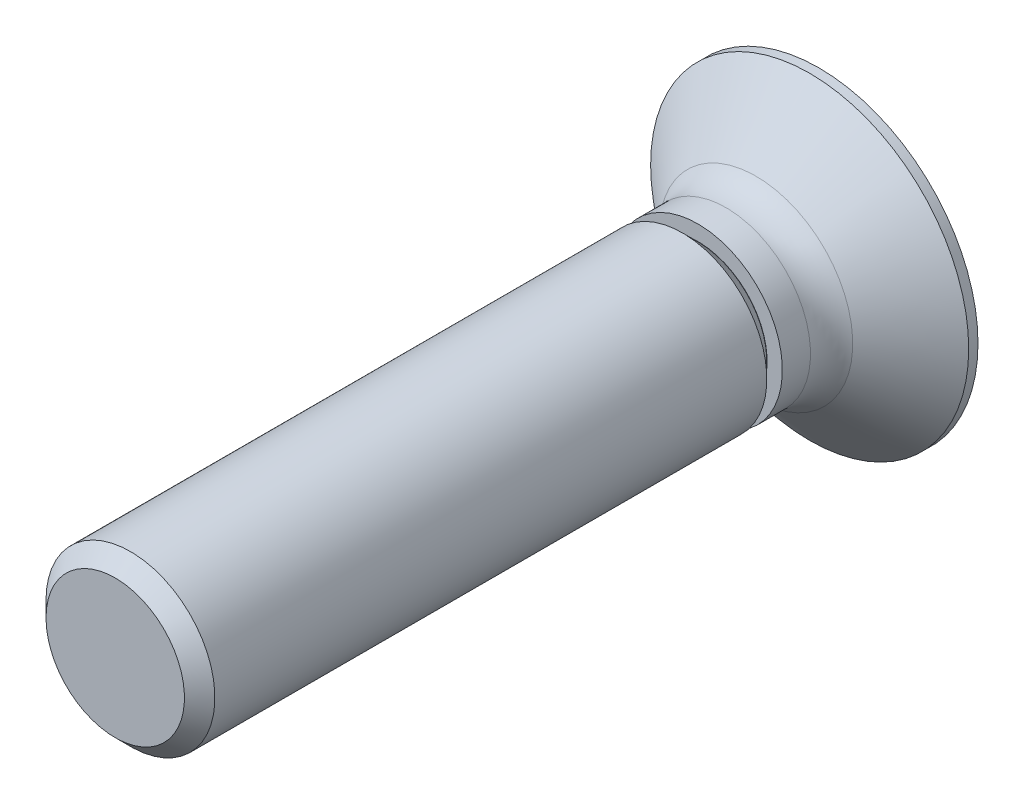
ISO-10303-21;
HEADER;
FILE_DESCRIPTION(('STEP AP214'),'2;1');
FILE_NAME('part.step','',(''),(''),'','','');
FILE_SCHEMA(('AUTOMOTIVE_DESIGN { 1 0 10303 214 1 1 1 1 }'));
ENDSEC;
DATA;
#1=APPLICATION_CONTEXT('core data for automotive mechanical design processes');
#2=APPLICATION_PROTOCOL_DEFINITION('international standard','automotive_design',2000,#1);
#3=PRODUCT_CONTEXT('',#1,'mechanical');
#4=PRODUCT('Part','Part','',(#3));
#5=PRODUCT_RELATED_PRODUCT_CATEGORY('part','',(#4));
#6=PRODUCT_DEFINITION_FORMATION('','',#4);
#7=PRODUCT_DEFINITION_CONTEXT('part definition',#1,'design');
#8=PRODUCT_DEFINITION('design','',#6,#7);
#9=PRODUCT_DEFINITION_SHAPE('','',#8);
#10=(LENGTH_UNIT() NAMED_UNIT(*) SI_UNIT(.MILLI.,.METRE.));
#11=(NAMED_UNIT(*) PLANE_ANGLE_UNIT() SI_UNIT($,.RADIAN.));
#12=(NAMED_UNIT(*) SI_UNIT($,.STERADIAN.) SOLID_ANGLE_UNIT());
#13=UNCERTAINTY_MEASURE_WITH_UNIT(LENGTH_MEASURE(1.E-05),#10,'distance_accuracy_value','');
#14=(GEOMETRIC_REPRESENTATION_CONTEXT(3) GLOBAL_UNCERTAINTY_ASSIGNED_CONTEXT((#13)) GLOBAL_UNIT_ASSIGNED_CONTEXT((#10,
#11,#12)) REPRESENTATION_CONTEXT('',''));
#15=CARTESIAN_POINT('',(0.,0.,0.));
#16=DIRECTION('',(0.,0.,1.));
#17=DIRECTION('',(1.,0.,0.));
#18=AXIS2_PLACEMENT_3D('',#15,#16,#17);
#19=CARTESIAN_POINT('',(0.,5.65,0.));
#20=DIRECTION('',(0.,0.,1.));
#21=DIRECTION('',(1.,0.,0.));
#22=AXIS2_PLACEMENT_3D('',#19,#20,#21);
#23=PLANE('',#22);
#24=CARTESIAN_POINT('',(0.,0.,0.));
#25=DIRECTION('',(0.,0.,-1.));
#26=DIRECTION('',(-1.,0.,0.));
#27=AXIS2_PLACEMENT_3D('',#24,#25,#26);
#28=CIRCLE('',#27,5.65);
#29=CARTESIAN_POINT('',(-5.65,0.,0.));
#30=VERTEX_POINT('',#29);
#31=EDGE_CURVE('E207',#30,#30,#28,.T.);
#32=ORIENTED_EDGE('',*,*,#31,.T.);
#33=EDGE_LOOP('',(#32));
#34=FACE_BOUND('',#33,.T.);
#35=DIRECTION('',(0.422618261740699,0.90630778703665,0.));
#36=VECTOR('',#35,1.);
#37=CARTESIAN_POINT('',(0.566666666666667,-3.4,0.));
#38=LINE('',#37,#36);
#39=CARTESIAN_POINT('',(0.566666666666667,-3.4,0.));
#40=VERTEX_POINT('',#39);
#41=CARTESIAN_POINT('',(1.46770883478955,-1.46770883478955,0.));
#42=VERTEX_POINT('',#41);
#43=EDGE_CURVE('E31',#40,#42,#38,.T.);
#44=ORIENTED_EDGE('',*,*,#43,.T.);
#45=DIRECTION('',(0.90630778703665,0.422618261740699,0.));
#46=VECTOR('',#45,1.);
#47=CARTESIAN_POINT('',(1.46770883478955,-1.46770883478955,0.));
#48=LINE('',#47,#46);
#49=CARTESIAN_POINT('',(3.4,-0.566666666666667,0.));
#50=VERTEX_POINT('',#49);
#51=EDGE_CURVE('E86',#42,#50,#48,.T.);
#52=ORIENTED_EDGE('',*,*,#51,.T.);
#53=DIRECTION('',(0.,1.,0.));
#54=VECTOR('',#53,1.);
#55=CARTESIAN_POINT('',(3.4,-0.566666666666667,0.));
#56=LINE('',#55,#54);
#57=CARTESIAN_POINT('',(3.4,0.566666666666667,0.));
#58=VERTEX_POINT('',#57);
#59=EDGE_CURVE('E167',#50,#58,#56,.T.);
#60=ORIENTED_EDGE('',*,*,#59,.T.);
#61=DIRECTION('',(-0.90630778703665,0.422618261740699,0.));
#62=VECTOR('',#61,1.);
#63=CARTESIAN_POINT('',(3.4,0.566666666666667,0.));
#64=LINE('',#63,#62);
#65=CARTESIAN_POINT('',(1.46770883478955,1.46770883478955,0.));
#66=VERTEX_POINT('',#65);
#67=EDGE_CURVE('E163',#58,#66,#64,.T.);
#68=ORIENTED_EDGE('',*,*,#67,.T.);
#69=DIRECTION('',(-0.4226182617407,0.90630778703665,0.));
#70=VECTOR('',#69,1.);
#71=CARTESIAN_POINT('',(1.46770883478955,1.46770883478955,0.));
#72=LINE('',#71,#70);
#73=CARTESIAN_POINT('',(0.566666666666667,3.4,0.));
#74=VERTEX_POINT('',#73);
#75=EDGE_CURVE('E159',#66,#74,#72,.T.);
#76=ORIENTED_EDGE('',*,*,#75,.T.);
#77=DIRECTION('',(-1.,0.,0.));
#78=VECTOR('',#77,1.);
#79=CARTESIAN_POINT('',(0.566666666666667,3.4,0.));
#80=LINE('',#79,#78);
#81=CARTESIAN_POINT('',(-0.566666666666666,3.4,0.));
#82=VERTEX_POINT('',#81);
#83=EDGE_CURVE('E155',#74,#82,#80,.T.);
#84=ORIENTED_EDGE('',*,*,#83,.T.);
#85=DIRECTION('',(-0.422618261740699,-0.90630778703665,0.));
#86=VECTOR('',#85,1.);
#87=CARTESIAN_POINT('',(-0.566666666666666,3.4,0.));
#88=LINE('',#87,#86);
#89=CARTESIAN_POINT('',(-1.46770883478955,1.46770883478955,0.));
#90=VERTEX_POINT('',#89);
#91=EDGE_CURVE('E151',#82,#90,#88,.T.);
#92=ORIENTED_EDGE('',*,*,#91,.T.);
#93=DIRECTION('',(-0.90630778703665,-0.422618261740699,0.));
#94=VECTOR('',#93,1.);
#95=CARTESIAN_POINT('',(-1.46770883478955,1.46770883478955,0.));
#96=LINE('',#95,#94);
#97=CARTESIAN_POINT('',(-3.4,0.566666666666668,0.));
#98=VERTEX_POINT('',#97);
#99=EDGE_CURVE('E147',#90,#98,#96,.T.);
#100=ORIENTED_EDGE('',*,*,#99,.T.);
#101=DIRECTION('',(0.,-1.,0.));
#102=VECTOR('',#101,1.);
#103=CARTESIAN_POINT('',(-3.4,0.566666666666668,0.));
#104=LINE('',#103,#102);
#105=CARTESIAN_POINT('',(-3.4,-0.566666666666667,0.));
#106=VERTEX_POINT('',#105);
#107=EDGE_CURVE('E142',#98,#106,#104,.T.);
#108=ORIENTED_EDGE('',*,*,#107,.T.);
#109=DIRECTION('',(0.90630778703665,-0.422618261740699,0.));
#110=VECTOR('',#109,1.);
#111=CARTESIAN_POINT('',(-3.4,-0.566666666666667,0.));
#112=LINE('',#111,#110);
#113=CARTESIAN_POINT('',(-1.46770883478955,-1.46770883478955,0.));
#114=VERTEX_POINT('',#113);
#115=EDGE_CURVE('E136',#106,#114,#112,.T.);
#116=ORIENTED_EDGE('',*,*,#115,.T.);
#117=DIRECTION('',(0.422618261740699,-0.90630778703665,0.));
#118=VECTOR('',#117,1.);
#119=CARTESIAN_POINT('',(-1.46770883478955,-1.46770883478955,0.));
#120=LINE('',#119,#118);
#121=CARTESIAN_POINT('',(-0.566666666666667,-3.4,0.));
#122=VERTEX_POINT('',#121);
#123=EDGE_CURVE('E119',#114,#122,#120,.T.);
#124=ORIENTED_EDGE('',*,*,#123,.T.);
#125=DIRECTION('',(1.,0.,0.));
#126=VECTOR('',#125,1.);
#127=CARTESIAN_POINT('',(-0.566666666666667,-3.4,0.));
#128=LINE('',#127,#126);
#129=EDGE_CURVE('E128',#122,#40,#128,.T.);
#130=ORIENTED_EDGE('',*,*,#129,.T.);
#131=EDGE_LOOP('',(#44,#52,#60,#68,#76,#84,#92,#100,#108,#116,#124,#130));
#132=FACE_BOUND('',#131,.T.);
#133=ADVANCED_FACE('F15',(#34,#132),#23,.F.);
#134=CARTESIAN_POINT('',(0.,0.,25.));
#135=DIRECTION('',(0.,0.,-1.));
#136=DIRECTION('',(-1.,0.,0.));
#137=AXIS2_PLACEMENT_3D('',#134,#135,#136);
#138=PLANE('',#137);
#139=CARTESIAN_POINT('',(0.,0.,25.));
#140=DIRECTION('',(0.,0.,-1.));
#141=DIRECTION('',(-1.,0.,0.));
#142=AXIS2_PLACEMENT_3D('',#139,#140,#141);
#143=CIRCLE('',#142,2.45875);
#144=CARTESIAN_POINT('',(-2.45875,0.,25.));
#145=VERTEX_POINT('',#144);
#146=EDGE_CURVE('E10',#145,#145,#143,.T.);
#147=ORIENTED_EDGE('',*,*,#146,.F.);
#148=EDGE_LOOP('',(#147));
#149=FACE_BOUND('',#148,.T.);
#150=ADVANCED_FACE('F17',(#149),#138,.F.);
#151=CARTESIAN_POINT('',(0.,0.,25.));
#152=DIRECTION('',(0.,0.,-1.));
#153=DIRECTION('',(-1.,0.,0.));
#154=AXIS2_PLACEMENT_3D('',#151,#152,#153);
#155=CONICAL_SURFACE('',#154,2.45875,0.785398163397453);
#156=CARTESIAN_POINT('',(0.,0.,24.45875));
#157=DIRECTION('',(0.,0.,-1.));
#158=DIRECTION('',(-1.,0.,0.));
#159=AXIS2_PLACEMENT_3D('',#156,#157,#158);
#160=CIRCLE('',#159,3.);
#161=CARTESIAN_POINT('',(-3.,0.,24.45875));
#162=VERTEX_POINT('',#161);
#163=EDGE_CURVE('E24',#162,#162,#160,.T.);
#164=ORIENTED_EDGE('',*,*,#163,.F.);
#165=EDGE_LOOP('',(#164));
#166=FACE_BOUND('',#165,.T.);
#167=ORIENTED_EDGE('',*,*,#146,.T.);
#168=EDGE_LOOP('',(#167));
#169=FACE_BOUND('',#168,.T.);
#170=ADVANCED_FACE('F279',(#166,#169),#155,.T.);
#171=CARTESIAN_POINT('',(0.,0.,0.));
#172=DIRECTION('',(0.,0.,-1.));
#173=DIRECTION('',(-1.,0.,0.));
#174=AXIS2_PLACEMENT_3D('',#171,#172,#173);
#175=CYLINDRICAL_SURFACE('',#174,3.);
#176=CARTESIAN_POINT('',(0.,0.,4.85125));
#177=DIRECTION('',(0.,0.,-1.));
#178=DIRECTION('',(-1.,0.,0.));
#179=AXIS2_PLACEMENT_3D('',#176,#177,#178);
#180=CIRCLE('',#179,3.);
#181=CARTESIAN_POINT('',(-3.,0.,4.85125));
#182=VERTEX_POINT('',#181);
#183=EDGE_CURVE('E267',#182,#182,#180,.T.);
#184=ORIENTED_EDGE('',*,*,#183,.F.);
#185=EDGE_LOOP('',(#184));
#186=FACE_BOUND('',#185,.T.);
#187=ORIENTED_EDGE('',*,*,#163,.T.);
#188=EDGE_LOOP('',(#187));
#189=FACE_BOUND('',#188,.T.);
#190=ADVANCED_FACE('F277',(#186,#189),#175,.T.);
#191=CARTESIAN_POINT('',(0.,0.,4.85125));
#192=DIRECTION('',(0.,0.,1.));
#193=DIRECTION('',(1.,0.,0.));
#194=AXIS2_PLACEMENT_3D('',#191,#192,#193);
#195=CONICAL_SURFACE('',#194,3.,0.785398163397449);
#196=CARTESIAN_POINT('',(0.,0.,4.31));
#197=DIRECTION('',(0.,0.,-1.));
#198=DIRECTION('',(-1.,0.,0.));
#199=AXIS2_PLACEMENT_3D('',#196,#197,#198);
#200=CIRCLE('',#199,2.45875);
#201=CARTESIAN_POINT('',(-2.45875,0.,4.31));
#202=VERTEX_POINT('',#201);
#203=EDGE_CURVE('E263',#202,#202,#200,.T.);
#204=ORIENTED_EDGE('',*,*,#203,.F.);
#205=EDGE_LOOP('',(#204));
#206=FACE_BOUND('',#205,.T.);
#207=ORIENTED_EDGE('',*,*,#183,.T.);
#208=EDGE_LOOP('',(#207));
#209=FACE_BOUND('',#208,.T.);
#210=ADVANCED_FACE('F320',(#206,#209),#195,.T.);
#211=CARTESIAN_POINT('',(0.,0.,0.));
#212=DIRECTION('',(0.,0.,-1.));
#213=DIRECTION('',(-1.,0.,0.));
#214=AXIS2_PLACEMENT_3D('',#211,#212,#213);
#215=CYLINDRICAL_SURFACE('',#214,2.45875);
#216=CARTESIAN_POINT('',(0.,0.,4.3));
#217=DIRECTION('',(0.,0.,-1.));
#218=DIRECTION('',(-1.,0.,0.));
#219=AXIS2_PLACEMENT_3D('',#216,#217,#218);
#220=CIRCLE('',#219,2.45875);
#221=CARTESIAN_POINT('',(-2.45875,0.,4.3));
#222=VERTEX_POINT('',#221);
#223=EDGE_CURVE('E259',#222,#222,#220,.T.);
#224=ORIENTED_EDGE('',*,*,#223,.F.);
#225=EDGE_LOOP('',(#224));
#226=FACE_BOUND('',#225,.T.);
#227=ORIENTED_EDGE('',*,*,#203,.T.);
#228=EDGE_LOOP('',(#227));
#229=FACE_BOUND('',#228,.T.);
#230=ADVANCED_FACE('F316',(#226,#229),#215,.T.);
#231=CARTESIAN_POINT('',(0.,2.45875,4.3));
#232=DIRECTION('',(0.,0.,-1.));
#233=DIRECTION('',(-1.,0.,0.));
#234=AXIS2_PLACEMENT_3D('',#231,#232,#233);
#235=PLANE('',#234);
#236=CARTESIAN_POINT('',(0.,0.,4.3));
#237=DIRECTION('',(0.,0.,-1.));
#238=DIRECTION('',(-1.,0.,0.));
#239=AXIS2_PLACEMENT_3D('',#236,#237,#238);
#240=CIRCLE('',#239,3.);
#241=CARTESIAN_POINT('',(-3.,0.,4.3));
#242=VERTEX_POINT('',#241);
#243=EDGE_CURVE('E255',#242,#242,#240,.T.);
#244=ORIENTED_EDGE('',*,*,#243,.F.);
#245=EDGE_LOOP('',(#244));
#246=FACE_BOUND('',#245,.T.);
#247=ORIENTED_EDGE('',*,*,#223,.T.);
#248=EDGE_LOOP('',(#247));
#249=FACE_BOUND('',#248,.T.);
#250=ADVANCED_FACE('F312',(#246,#249),#235,.F.);
#251=CARTESIAN_POINT('',(0.,0.,0.));
#252=DIRECTION('',(0.,0.,-1.));
#253=DIRECTION('',(-1.,0.,0.));
#254=AXIS2_PLACEMENT_3D('',#251,#252,#253);
#255=CYLINDRICAL_SURFACE('',#254,3.);
#256=CARTESIAN_POINT('',(0.,0.,3.3));
#257=DIRECTION('',(0.,0.,-1.));
#258=DIRECTION('',(-1.,0.,0.));
#259=AXIS2_PLACEMENT_3D('',#256,#257,#258);
#260=CIRCLE('',#259,3.);
#261=CARTESIAN_POINT('',(-3.,0.,3.3));
#262=VERTEX_POINT('',#261);
#263=EDGE_CURVE('E251',#262,#262,#260,.T.);
#264=ORIENTED_EDGE('',*,*,#263,.F.);
#265=EDGE_LOOP('',(#264));
#266=FACE_BOUND('',#265,.T.);
#267=ORIENTED_EDGE('',*,*,#243,.T.);
#268=EDGE_LOOP('',(#267));
#269=FACE_BOUND('',#268,.T.);
#270=ADVANCED_FACE('F308',(#266,#269),#255,.T.);
#271=CARTESIAN_POINT('',(0.,0.,3.3));
#272=DIRECTION('',(0.,0.,-1.));
#273=DIRECTION('',(-1.,0.,0.));
#274=AXIS2_PLACEMENT_3D('',#271,#272,#273);
#275=TOROIDAL_SURFACE('',#274,4.5,1.5);
#276=ORIENTED_EDGE('',*,*,#263,.T.);
#277=EDGE_LOOP('',(#276));
#278=FACE_BOUND('',#277,.T.);
#279=CARTESIAN_POINT('',(0.,0.,2.23933982822018));
#280=DIRECTION('',(0.,0.,-1.));
#281=DIRECTION('',(-1.,0.,0.));
#282=AXIS2_PLACEMENT_3D('',#279,#280,#281);
#283=CIRCLE('',#282,3.43933982822018);
#284=CARTESIAN_POINT('',(-3.43933982822018,0.,2.23933982822018));
#285=VERTEX_POINT('',#284);
#286=EDGE_CURVE('E247',#285,#285,#283,.T.);
#287=ORIENTED_EDGE('',*,*,#286,.F.);
#288=EDGE_LOOP('',(#287));
#289=FACE_BOUND('',#288,.T.);
#290=ADVANCED_FACE('F304',(#278,#289),#275,.F.);
#291=CARTESIAN_POINT('',(0.,0.,2.23933982822018));
#292=DIRECTION('',(0.,0.,-1.));
#293=DIRECTION('',(-1.,0.,0.));
#294=AXIS2_PLACEMENT_3D('',#291,#292,#293);
#295=CONICAL_SURFACE('',#294,3.43933982822018,0.858404187555627);
#296=CARTESIAN_POINT('',(0.,0.,0.33));
#297=DIRECTION('',(0.,0.,-1.));
#298=DIRECTION('',(-1.,0.,0.));
#299=AXIS2_PLACEMENT_3D('',#296,#297,#298);
#300=CIRCLE('',#299,5.65);
#301=CARTESIAN_POINT('',(-5.65,0.,0.33));
#302=VERTEX_POINT('',#301);
#303=EDGE_CURVE('E243',#302,#302,#300,.T.);
#304=ORIENTED_EDGE('',*,*,#303,.F.);
#305=EDGE_LOOP('',(#304));
#306=FACE_BOUND('',#305,.T.);
#307=ORIENTED_EDGE('',*,*,#286,.T.);
#308=EDGE_LOOP('',(#307));
#309=FACE_BOUND('',#308,.T.);
#310=ADVANCED_FACE('F300',(#306,#309),#295,.T.);
#311=CARTESIAN_POINT('',(0.,0.,0.));
#312=DIRECTION('',(0.,0.,-1.));
#313=DIRECTION('',(-1.,0.,0.));
#314=AXIS2_PLACEMENT_3D('',#311,#312,#313);
#315=CYLINDRICAL_SURFACE('',#314,5.65);
#316=ORIENTED_EDGE('',*,*,#31,.F.);
#317=EDGE_LOOP('',(#316));
#318=FACE_BOUND('',#317,.T.);
#319=ORIENTED_EDGE('',*,*,#303,.T.);
#320=EDGE_LOOP('',(#319));
#321=FACE_BOUND('',#320,.T.);
#322=ADVANCED_FACE('F297',(#318,#321),#315,.T.);
#323=CARTESIAN_POINT('',(0.566666666666667,-3.4,0.));
#324=DIRECTION('',(0.875426098065593,-0.408217893676735,0.258819045102521));
#325=DIRECTION('',(0.422618261740699,0.90630778703665,0.));
#326=AXIS2_PLACEMENT_3D('',#323,#324,#325);
#327=PLANE('',#326);
#328=ORIENTED_EDGE('',*,*,#43,.F.);
#329=DIRECTION('',(0.162689201767992,-0.255370893567974,-0.953057149569945));
#330=VECTOR('',#329,1.);
#331=CARTESIAN_POINT('',(0.566666666666667,-3.4,0.));
#332=LINE('',#331,#330);
#333=CARTESIAN_POINT('',(0.054559280950909,-2.59615242270664,3.));
#334=VERTEX_POINT('',#333);
#335=EDGE_CURVE('E125',#334,#40,#332,.T.);
#336=ORIENTED_EDGE('',*,*,#335,.F.);
#337=DIRECTION('',(-0.422618261740699,-0.90630778703665,0.));
#338=VECTOR('',#337,1.);
#339=CARTESIAN_POINT('',(-0.161866652224858,-3.0602793341798,3.));
#340=LINE('',#339,#338);
#341=CARTESIAN_POINT('',(0.862823726221668,-0.862823726221669,3.));
#342=VERTEX_POINT('',#341);
#343=EDGE_CURVE('E132',#334,#342,#340,.F.);
#344=ORIENTED_EDGE('',*,*,#343,.T.);
#345=DIRECTION('',(0.193899607686987,-0.193899607686987,-0.961668281829896));
#346=VECTOR('',#345,1.);
#347=CARTESIAN_POINT('',(1.50648076300232,-1.50648076300232,-0.192294012517031));
#348=LINE('',#347,#346);
#349=EDGE_CURVE('E204',#342,#42,#348,.T.);
#350=ORIENTED_EDGE('',*,*,#349,.T.);
#351=EDGE_LOOP('',(#328,#336,#344,#350));
#352=FACE_BOUND('',#351,.T.);
#353=ADVANCED_FACE('F295',(#352),#327,.F.);
#354=CARTESIAN_POINT('',(1.46770883478955,-1.46770883478955,0.));
#355=DIRECTION('',(0.408217893676735,-0.875426098065593,0.258819045102521));
#356=DIRECTION('',(0.90630778703665,0.422618261740699,0.));
#357=AXIS2_PLACEMENT_3D('',#354,#355,#356);
#358=PLANE('',#357);
#359=ORIENTED_EDGE('',*,*,#51,.F.);
#360=ORIENTED_EDGE('',*,*,#349,.F.);
#361=DIRECTION('',(-0.90630778703665,-0.422618261740699,0.));
#362=VECTOR('',#361,1.);
#363=CARTESIAN_POINT('',(1.12798816896935,-0.739175515898022,3.));
#364=LINE('',#363,#362);
#365=CARTESIAN_POINT('',(2.59615242270664,-0.0545592809509093,3.));
#366=VERTEX_POINT('',#365);
#367=EDGE_CURVE('E40',#342,#366,#364,.F.);
#368=ORIENTED_EDGE('',*,*,#367,.T.);
#369=DIRECTION('',(0.255370893567974,-0.162689201767992,-0.953057149569945));
#370=VECTOR('',#369,1.);
#371=CARTESIAN_POINT('',(3.4,-0.566666666666667,0.));
#372=LINE('',#371,#370);
#373=EDGE_CURVE('E201',#366,#50,#372,.T.);
#374=ORIENTED_EDGE('',*,*,#373,.T.);
#375=EDGE_LOOP('',(#359,#360,#368,#374));
#376=FACE_BOUND('',#375,.T.);
#377=ADVANCED_FACE('F369',(#376),#358,.F.);
#378=CARTESIAN_POINT('',(3.4,-0.566666666666667,0.));
#379=DIRECTION('',(0.965925826289068,0.,0.258819045102521));
#380=DIRECTION('',(0.258819045102521,0.,-0.965925826289068));
#381=AXIS2_PLACEMENT_3D('',#378,#379,#380);
#382=PLANE('',#381);
#383=ORIENTED_EDGE('',*,*,#59,.F.);
#384=ORIENTED_EDGE('',*,*,#373,.F.);
#385=DIRECTION('',(0.,-1.,0.));
#386=VECTOR('',#385,1.);
#387=CARTESIAN_POINT('',(2.59615242270664,-0.566666666666667,3.));
#388=LINE('',#387,#386);
#389=CARTESIAN_POINT('',(2.59615242270664,0.0545592809509093,3.));
#390=VERTEX_POINT('',#389);
#391=EDGE_CURVE('E214',#366,#390,#388,.F.);
#392=ORIENTED_EDGE('',*,*,#391,.T.);
#393=DIRECTION('',(0.255370893567974,0.162689201767992,-0.953057149569945));
#394=VECTOR('',#393,1.);
#395=CARTESIAN_POINT('',(3.4,0.566666666666667,0.));
#396=LINE('',#395,#394);
#397=EDGE_CURVE('E198',#390,#58,#396,.T.);
#398=ORIENTED_EDGE('',*,*,#397,.T.);
#399=EDGE_LOOP('',(#383,#384,#392,#398));
#400=FACE_BOUND('',#399,.T.);
#401=ADVANCED_FACE('F375',(#400),#382,.F.);
#402=CARTESIAN_POINT('',(3.4,0.566666666666667,0.));
#403=DIRECTION('',(0.408217893676735,0.875426098065593,0.258819045102521));
#404=DIRECTION('',(-0.90630778703665,0.422618261740699,0.));
#405=AXIS2_PLACEMENT_3D('',#402,#403,#404);
#406=PLANE('',#405);
#407=ORIENTED_EDGE('',*,*,#67,.F.);
#408=ORIENTED_EDGE('',*,*,#397,.F.);
#409=DIRECTION('',(0.90630778703665,-0.422618261740699,0.));
#410=VECTOR('',#409,1.);
#411=CARTESIAN_POINT('',(3.0602793341798,-0.161866652224858,3.));
#412=LINE('',#411,#410);
#413=CARTESIAN_POINT('',(0.862823726221672,0.862823726221668,3.));
#414=VERTEX_POINT('',#413);
#415=EDGE_CURVE('E217',#390,#414,#412,.F.);
#416=ORIENTED_EDGE('',*,*,#415,.T.);
#417=DIRECTION('',(0.193899607686987,0.193899607686987,-0.961668281829896));
#418=VECTOR('',#417,1.);
#419=CARTESIAN_POINT('',(1.50648076300232,1.50648076300232,-0.192294012517031));
#420=LINE('',#419,#418);
#421=EDGE_CURVE('E195',#414,#66,#420,.T.);
#422=ORIENTED_EDGE('',*,*,#421,.T.);
#423=EDGE_LOOP('',(#407,#408,#416,#422));
#424=FACE_BOUND('',#423,.T.);
#425=ADVANCED_FACE('F381',(#424),#406,.F.);
#426=CARTESIAN_POINT('',(1.46770883478955,1.46770883478955,0.));
#427=DIRECTION('',(0.875426098065593,0.408217893676735,0.258819045102521));
#428=DIRECTION('',(-0.4226182617407,0.90630778703665,0.));
#429=AXIS2_PLACEMENT_3D('',#426,#427,#428);
#430=PLANE('',#429);
#431=ORIENTED_EDGE('',*,*,#75,.F.);
#432=ORIENTED_EDGE('',*,*,#421,.F.);
#433=DIRECTION('',(0.4226182617407,-0.90630778703665,0.));
#434=VECTOR('',#433,1.);
#435=CARTESIAN_POINT('',(0.739175515898024,1.12798816896935,3.));
#436=LINE('',#435,#434);
#437=CARTESIAN_POINT('',(0.0545592809509098,2.59615242270663,3.));
#438=VERTEX_POINT('',#437);
#439=EDGE_CURVE('E220',#414,#438,#436,.F.);
#440=ORIENTED_EDGE('',*,*,#439,.T.);
#441=DIRECTION('',(0.162689201767992,0.255370893567974,-0.953057149569945));
#442=VECTOR('',#441,1.);
#443=CARTESIAN_POINT('',(0.566666666666667,3.4,0.));
#444=LINE('',#443,#442);
#445=EDGE_CURVE('E192',#438,#74,#444,.T.);
#446=ORIENTED_EDGE('',*,*,#445,.T.);
#447=EDGE_LOOP('',(#431,#432,#440,#446));
#448=FACE_BOUND('',#447,.T.);
#449=ADVANCED_FACE('F389',(#448),#430,.F.);
#450=CARTESIAN_POINT('',(0.566666666666667,3.4,0.));
#451=DIRECTION('',(0.,0.965925826289068,0.258819045102521));
#452=DIRECTION('',(0.,-0.258819045102521,0.965925826289068));
#453=AXIS2_PLACEMENT_3D('',#450,#451,#452);
#454=PLANE('',#453);
#455=ORIENTED_EDGE('',*,*,#83,.F.);
#456=ORIENTED_EDGE('',*,*,#445,.F.);
#457=DIRECTION('',(1.,0.,0.));
#458=VECTOR('',#457,1.);
#459=CARTESIAN_POINT('',(0.566666666666667,2.59615242270663,3.));
#460=LINE('',#459,#458);
#461=CARTESIAN_POINT('',(-0.0545592809509085,2.59615242270663,3.));
#462=VERTEX_POINT('',#461);
#463=EDGE_CURVE('E223',#438,#462,#460,.F.);
#464=ORIENTED_EDGE('',*,*,#463,.T.);
#465=DIRECTION('',(-0.162689201767992,0.255370893567974,-0.953057149569945));
#466=VECTOR('',#465,1.);
#467=CARTESIAN_POINT('',(-0.566666666666666,3.4,0.));
#468=LINE('',#467,#466);
#469=EDGE_CURVE('E189',#462,#82,#468,.T.);
#470=ORIENTED_EDGE('',*,*,#469,.T.);
#471=EDGE_LOOP('',(#455,#456,#464,#470));
#472=FACE_BOUND('',#471,.T.);
#473=ADVANCED_FACE('F397',(#472),#454,.F.);
#474=CARTESIAN_POINT('',(-0.566666666666666,3.4,0.));
#475=DIRECTION('',(-0.875426098065593,0.408217893676735,0.258819045102521));
#476=DIRECTION('',(-0.422618261740699,-0.90630778703665,0.));
#477=AXIS2_PLACEMENT_3D('',#474,#475,#476);
#478=PLANE('',#477);
#479=ORIENTED_EDGE('',*,*,#91,.F.);
#480=ORIENTED_EDGE('',*,*,#469,.F.);
#481=DIRECTION('',(0.422618261740699,0.90630778703665,0.));
#482=VECTOR('',#481,1.);
#483=CARTESIAN_POINT('',(0.161866652224859,3.0602793341798,3.));
#484=LINE('',#483,#482);
#485=CARTESIAN_POINT('',(-0.862823726221667,0.862823726221669,3.));
#486=VERTEX_POINT('',#485);
#487=EDGE_CURVE('E226',#462,#486,#484,.F.);
#488=ORIENTED_EDGE('',*,*,#487,.T.);
#489=DIRECTION('',(-0.193899607686987,0.193899607686987,-0.961668281829896));
#490=VECTOR('',#489,1.);
#491=CARTESIAN_POINT('',(-1.50648076300232,1.50648076300232,-0.192294012517031));
#492=LINE('',#491,#490);
#493=EDGE_CURVE('E186',#486,#90,#492,.T.);
#494=ORIENTED_EDGE('',*,*,#493,.T.);
#495=EDGE_LOOP('',(#479,#480,#488,#494));
#496=FACE_BOUND('',#495,.T.);
#497=ADVANCED_FACE('F405',(#496),#478,.F.);
#498=CARTESIAN_POINT('',(-1.46770883478955,1.46770883478955,0.));
#499=DIRECTION('',(-0.408217893676735,0.875426098065593,0.258819045102521));
#500=DIRECTION('',(-0.90630778703665,-0.422618261740699,0.));
#501=AXIS2_PLACEMENT_3D('',#498,#499,#500);
#502=PLANE('',#501);
#503=ORIENTED_EDGE('',*,*,#99,.F.);
#504=ORIENTED_EDGE('',*,*,#493,.F.);
#505=DIRECTION('',(0.90630778703665,0.422618261740699,0.));
#506=VECTOR('',#505,1.);
#507=CARTESIAN_POINT('',(-1.12798816896935,0.739175515898022,3.));
#508=LINE('',#507,#506);
#509=CARTESIAN_POINT('',(-2.59615242270663,0.0545592809509099,3.));
#510=VERTEX_POINT('',#509);
#511=EDGE_CURVE('E229',#486,#510,#508,.F.);
#512=ORIENTED_EDGE('',*,*,#511,.T.);
#513=DIRECTION('',(-0.255370893567974,0.162689201767992,-0.953057149569945));
#514=VECTOR('',#513,1.);
#515=CARTESIAN_POINT('',(-3.4,0.566666666666668,0.));
#516=LINE('',#515,#514);
#517=EDGE_CURVE('E183',#510,#98,#516,.T.);
#518=ORIENTED_EDGE('',*,*,#517,.T.);
#519=EDGE_LOOP('',(#503,#504,#512,#518));
#520=FACE_BOUND('',#519,.T.);
#521=ADVANCED_FACE('F413',(#520),#502,.F.);
#522=CARTESIAN_POINT('',(-3.4,0.566666666666668,0.));
#523=DIRECTION('',(-0.965925826289068,0.,0.258819045102521));
#524=DIRECTION('',(0.258819045102521,0.,0.965925826289068));
#525=AXIS2_PLACEMENT_3D('',#522,#523,#524);
#526=PLANE('',#525);
#527=ORIENTED_EDGE('',*,*,#107,.F.);
#528=ORIENTED_EDGE('',*,*,#517,.F.);
#529=DIRECTION('',(0.,1.,0.));
#530=VECTOR('',#529,1.);
#531=CARTESIAN_POINT('',(-2.59615242270663,0.566666666666668,3.));
#532=LINE('',#531,#530);
#533=CARTESIAN_POINT('',(-2.59615242270663,-0.0545592809509088,3.));
#534=VERTEX_POINT('',#533);
#535=EDGE_CURVE('E232',#510,#534,#532,.F.);
#536=ORIENTED_EDGE('',*,*,#535,.T.);
#537=DIRECTION('',(-0.255370893567974,-0.162689201767992,-0.953057149569945));
#538=VECTOR('',#537,1.);
#539=CARTESIAN_POINT('',(-3.4,-0.566666666666667,0.));
#540=LINE('',#539,#538);
#541=EDGE_CURVE('E180',#534,#106,#540,.T.);
#542=ORIENTED_EDGE('',*,*,#541,.T.);
#543=EDGE_LOOP('',(#527,#528,#536,#542));
#544=FACE_BOUND('',#543,.T.);
#545=ADVANCED_FACE('F421',(#544),#526,.F.);
#546=CARTESIAN_POINT('',(-3.4,-0.566666666666667,0.));
#547=DIRECTION('',(-0.408217893676735,-0.875426098065593,0.258819045102521));
#548=DIRECTION('',(0.90630778703665,-0.422618261740699,0.));
#549=AXIS2_PLACEMENT_3D('',#546,#547,#548);
#550=PLANE('',#549);
#551=ORIENTED_EDGE('',*,*,#115,.F.);
#552=ORIENTED_EDGE('',*,*,#541,.F.);
#553=DIRECTION('',(-0.90630778703665,0.422618261740699,0.));
#554=VECTOR('',#553,1.);
#555=CARTESIAN_POINT('',(-3.0602793341798,0.161866652224858,3.));
#556=LINE('',#555,#554);
#557=CARTESIAN_POINT('',(-0.86282372622167,-0.862823726221668,3.));
#558=VERTEX_POINT('',#557);
#559=EDGE_CURVE('E235',#534,#558,#556,.F.);
#560=ORIENTED_EDGE('',*,*,#559,.T.);
#561=DIRECTION('',(-0.193899607686987,-0.193899607686987,-0.961668281829896));
#562=VECTOR('',#561,1.);
#563=CARTESIAN_POINT('',(-1.50648076300232,-1.50648076300232,-0.192294012517031));
#564=LINE('',#563,#562);
#565=EDGE_CURVE('E124',#558,#114,#564,.T.);
#566=ORIENTED_EDGE('',*,*,#565,.T.);
#567=EDGE_LOOP('',(#551,#552,#560,#566));
#568=FACE_BOUND('',#567,.T.);
#569=ADVANCED_FACE('F429',(#568),#550,.F.);
#570=CARTESIAN_POINT('',(-1.46770883478955,-1.46770883478955,0.));
#571=DIRECTION('',(-0.875426098065593,-0.408217893676735,0.258819045102521));
#572=DIRECTION('',(0.422618261740699,-0.90630778703665,0.));
#573=AXIS2_PLACEMENT_3D('',#570,#571,#572);
#574=PLANE('',#573);
#575=ORIENTED_EDGE('',*,*,#123,.F.);
#576=ORIENTED_EDGE('',*,*,#565,.F.);
#577=DIRECTION('',(-0.422618261740699,0.90630778703665,0.));
#578=VECTOR('',#577,1.);
#579=CARTESIAN_POINT('',(-0.739175515898023,-1.12798816896935,3.));
#580=LINE('',#579,#578);
#581=CARTESIAN_POINT('',(-0.0545592809509092,-2.59615242270664,3.));
#582=VERTEX_POINT('',#581);
#583=EDGE_CURVE('E77',#558,#582,#580,.F.);
#584=ORIENTED_EDGE('',*,*,#583,.T.);
#585=DIRECTION('',(-0.162689201767992,-0.255370893567974,-0.953057149569945));
#586=VECTOR('',#585,1.);
#587=CARTESIAN_POINT('',(-0.566666666666667,-3.4,0.));
#588=LINE('',#587,#586);
#589=EDGE_CURVE('E115',#582,#122,#588,.T.);
#590=ORIENTED_EDGE('',*,*,#589,.T.);
#591=EDGE_LOOP('',(#575,#576,#584,#590));
#592=FACE_BOUND('',#591,.T.);
#593=ADVANCED_FACE('F117',(#592),#574,.F.);
#594=CARTESIAN_POINT('',(-0.566666666666667,-3.4,0.));
#595=DIRECTION('',(0.,-0.965925826289068,0.258819045102521));
#596=DIRECTION('',(0.,-0.258819045102521,-0.965925826289068));
#597=AXIS2_PLACEMENT_3D('',#594,#595,#596);
#598=PLANE('',#597);
#599=ORIENTED_EDGE('',*,*,#129,.F.);
#600=ORIENTED_EDGE('',*,*,#589,.F.);
#601=DIRECTION('',(-1.,0.,0.));
#602=VECTOR('',#601,1.);
#603=CARTESIAN_POINT('',(-0.566666666666667,-2.59615242270664,3.));
#604=LINE('',#603,#602);
#605=EDGE_CURVE('E176',#582,#334,#604,.F.);
#606=ORIENTED_EDGE('',*,*,#605,.T.);
#607=ORIENTED_EDGE('',*,*,#335,.T.);
#608=EDGE_LOOP('',(#599,#600,#606,#607));
#609=FACE_BOUND('',#608,.T.);
#610=ADVANCED_FACE('F129',(#609),#598,.F.);
#611=CARTESIAN_POINT('',(2.59203903179671,0.943425053630189,3.));
#612=DIRECTION('',(0.,0.,1.));
#613=DIRECTION('',(1.,0.,0.));
#614=AXIS2_PLACEMENT_3D('',#611,#612,#613);
#615=PLANE('',#614);
#616=ORIENTED_EDGE('',*,*,#343,.F.);
#617=ORIENTED_EDGE('',*,*,#605,.F.);
#618=ORIENTED_EDGE('',*,*,#583,.F.);
#619=ORIENTED_EDGE('',*,*,#559,.F.);
#620=ORIENTED_EDGE('',*,*,#535,.F.);
#621=ORIENTED_EDGE('',*,*,#511,.F.);
#622=ORIENTED_EDGE('',*,*,#487,.F.);
#623=ORIENTED_EDGE('',*,*,#463,.F.);
#624=ORIENTED_EDGE('',*,*,#439,.F.);
#625=ORIENTED_EDGE('',*,*,#415,.F.);
#626=ORIENTED_EDGE('',*,*,#391,.F.);
#627=ORIENTED_EDGE('',*,*,#367,.F.);
#628=EDGE_LOOP('',(#616,#617,#618,#619,#620,#621,#622,#623,#624,#625,#626,#627));
#629=FACE_BOUND('',#628,.T.);
#630=ADVANCED_FACE('F450',(#629),#615,.F.);
#631=CLOSED_SHELL('',(#133,#150,#170,#190,#210,#230,#250,#270,#290,#310,#322,#353,#377,#401,
#425,#449,#473,#497,#521,#545,#569,#593,#610,#630));
#632=MANIFOLD_SOLID_BREP('B1',#631);
#633=ADVANCED_BREP_SHAPE_REPRESENTATION('',(#18,#632),#14);
#634=SHAPE_DEFINITION_REPRESENTATION(#9,#633);
ENDSEC;
END-ISO-10303-21;
